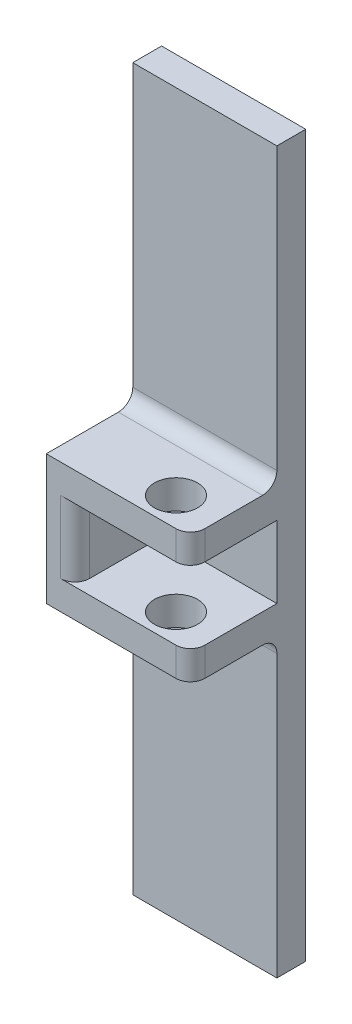
ISO-10303-21;
HEADER;
FILE_DESCRIPTION(('STEP AP214'),'2;1');
FILE_NAME('part.step','',(''),(''),'','','');
FILE_SCHEMA(('AUTOMOTIVE_DESIGN { 1 0 10303 214 1 1 1 1 }'));
ENDSEC;
DATA;
#1=APPLICATION_CONTEXT('core data for automotive mechanical design processes');
#2=APPLICATION_PROTOCOL_DEFINITION('international standard','automotive_design',2000,#1);
#3=PRODUCT_CONTEXT('',#1,'mechanical');
#4=PRODUCT('Part','Part','',(#3));
#5=PRODUCT_RELATED_PRODUCT_CATEGORY('part','',(#4));
#6=PRODUCT_DEFINITION_FORMATION('','',#4);
#7=PRODUCT_DEFINITION_CONTEXT('part definition',#1,'design');
#8=PRODUCT_DEFINITION('design','',#6,#7);
#9=PRODUCT_DEFINITION_SHAPE('','',#8);
#10=(LENGTH_UNIT() NAMED_UNIT(*) SI_UNIT(.MILLI.,.METRE.));
#11=(NAMED_UNIT(*) PLANE_ANGLE_UNIT() SI_UNIT($,.RADIAN.));
#12=(NAMED_UNIT(*) SI_UNIT($,.STERADIAN.) SOLID_ANGLE_UNIT());
#13=UNCERTAINTY_MEASURE_WITH_UNIT(LENGTH_MEASURE(1.E-05),#10,'distance_accuracy_value','');
#14=(GEOMETRIC_REPRESENTATION_CONTEXT(3) GLOBAL_UNCERTAINTY_ASSIGNED_CONTEXT((#13)) GLOBAL_UNIT_ASSIGNED_CONTEXT((#10,
#11,#12)) REPRESENTATION_CONTEXT('',''));
#15=CARTESIAN_POINT('',(0.,0.,0.));
#16=DIRECTION('',(0.,0.,1.));
#17=DIRECTION('',(1.,0.,0.));
#18=AXIS2_PLACEMENT_3D('',#15,#16,#17);
#19=CARTESIAN_POINT('',(0.,0.,3.));
#20=DIRECTION('',(0.,0.,-1.));
#21=DIRECTION('',(-1.,0.,0.));
#22=AXIS2_PLACEMENT_3D('',#19,#20,#21);
#23=PLANE('',#22);
#24=DIRECTION('',(0.,-1.,0.));
#25=VECTOR('',#24,1.);
#26=CARTESIAN_POINT('',(2.,27.5,3.));
#27=LINE('',#26,#25);
#28=CARTESIAN_POINT('',(2.,27.5,3.));
#29=VERTEX_POINT('',#28);
#30=CARTESIAN_POINT('',(2.,22.5,3.));
#31=VERTEX_POINT('',#30);
#32=EDGE_CURVE('E173',#29,#31,#27,.T.);
#33=ORIENTED_EDGE('',*,*,#32,.T.);
#34=DIRECTION('',(-1.,0.,0.));
#35=VECTOR('',#34,1.);
#36=CARTESIAN_POINT('',(0.,22.5,3.));
#37=LINE('',#36,#35);
#38=CARTESIAN_POINT('',(9.99999999999999,22.5,3.));
#39=VERTEX_POINT('',#38);
#40=EDGE_CURVE('E184',#39,#31,#37,.T.);
#41=ORIENTED_EDGE('',*,*,#40,.F.);
#42=DIRECTION('',(0.,1.,0.));
#43=VECTOR('',#42,1.);
#44=CARTESIAN_POINT('',(10.,0.,3.));
#45=LINE('',#44,#43);
#46=CARTESIAN_POINT('',(9.99999999999999,27.5,3.));
#47=VERTEX_POINT('',#46);
#48=EDGE_CURVE('E254',#39,#47,#45,.T.);
#49=ORIENTED_EDGE('',*,*,#48,.T.);
#50=DIRECTION('',(1.,0.,0.));
#51=VECTOR('',#50,1.);
#52=CARTESIAN_POINT('',(0.,27.5,3.));
#53=LINE('',#52,#51);
#54=EDGE_CURVE('E185',#29,#47,#53,.T.);
#55=ORIENTED_EDGE('',*,*,#54,.F.);
#56=EDGE_LOOP('',(#33,#41,#49,#55));
#57=FACE_BOUND('',#56,.T.);
#58=ADVANCED_FACE('F41',(#57),#23,.F.);
#59=CARTESIAN_POINT('',(0.,27.5,9.));
#60=DIRECTION('',(0.,1.,0.));
#61=DIRECTION('',(0.,0.,1.));
#62=AXIS2_PLACEMENT_3D('',#59,#60,#61);
#63=PLANE('',#62);
#64=CARTESIAN_POINT('',(6.99999999999999,27.5,7.));
#65=DIRECTION('',(0.,1.,0.));
#66=DIRECTION('',(0.,0.,1.));
#67=AXIS2_PLACEMENT_3D('',#64,#65,#66);
#68=CIRCLE('',#67,1.5);
#69=CARTESIAN_POINT('',(6.99999999999999,27.5,8.5));
#70=VERTEX_POINT('',#69);
#71=EDGE_CURVE('E194',#70,#70,#68,.T.);
#72=ORIENTED_EDGE('',*,*,#71,.T.);
#73=EDGE_LOOP('',(#72));
#74=FACE_BOUND('',#73,.T.);
#75=DIRECTION('',(1.,0.,0.));
#76=VECTOR('',#75,1.);
#77=CARTESIAN_POINT('',(0.,27.5,9.));
#78=LINE('',#77,#76);
#79=CARTESIAN_POINT('',(1.,27.5,9.));
#80=VERTEX_POINT('',#79);
#81=CARTESIAN_POINT('',(8.99999999999999,27.5,9.));
#82=VERTEX_POINT('',#81);
#83=EDGE_CURVE('E219',#80,#82,#78,.T.);
#84=ORIENTED_EDGE('',*,*,#83,.F.);
#85=CARTESIAN_POINT('',(1.,27.5,8.));
#86=DIRECTION('',(0.,1.,0.));
#87=DIRECTION('',(0.,0.,1.));
#88=AXIS2_PLACEMENT_3D('',#85,#86,#87);
#89=CIRCLE('',#88,1.);
#90=CARTESIAN_POINT('',(2.,27.5,8.));
#91=VERTEX_POINT('',#90);
#92=EDGE_CURVE('E50',#80,#91,#89,.T.);
#93=ORIENTED_EDGE('',*,*,#92,.T.);
#94=DIRECTION('',(0.,0.,-1.));
#95=VECTOR('',#94,1.);
#96=CARTESIAN_POINT('',(2.,27.5,3.));
#97=LINE('',#96,#95);
#98=EDGE_CURVE('E179',#91,#29,#97,.T.);
#99=ORIENTED_EDGE('',*,*,#98,.T.);
#100=ORIENTED_EDGE('',*,*,#54,.T.);
#101=DIRECTION('',(0.,0.,-1.));
#102=VECTOR('',#101,1.);
#103=CARTESIAN_POINT('',(9.99999999999999,27.5,9.));
#104=LINE('',#103,#102);
#105=CARTESIAN_POINT('',(9.99999999999999,27.5,8.));
#106=VERTEX_POINT('',#105);
#107=EDGE_CURVE('E235',#106,#47,#104,.T.);
#108=ORIENTED_EDGE('',*,*,#107,.F.);
#109=CARTESIAN_POINT('',(8.99999999999999,27.5,8.));
#110=DIRECTION('',(0.,1.,0.));
#111=DIRECTION('',(0.,0.,1.));
#112=AXIS2_PLACEMENT_3D('',#109,#110,#111);
#113=CIRCLE('',#112,1.);
#114=EDGE_CURVE('E330',#106,#82,#113,.F.);
#115=ORIENTED_EDGE('',*,*,#114,.T.);
#116=EDGE_LOOP('',(#84,#93,#99,#100,#108,#115));
#117=FACE_BOUND('',#116,.T.);
#118=ADVANCED_FACE('F393',(#74,#117),#63,.F.);
#119=CARTESIAN_POINT('',(0.,22.5,9.));
#120=DIRECTION('',(0.,-1.,0.));
#121=DIRECTION('',(0.,0.,-1.));
#122=AXIS2_PLACEMENT_3D('',#119,#120,#121);
#123=PLANE('',#122);
#124=CARTESIAN_POINT('',(6.99999999999999,22.5,7.));
#125=DIRECTION('',(0.,-1.,0.));
#126=DIRECTION('',(0.,0.,-1.));
#127=AXIS2_PLACEMENT_3D('',#124,#125,#126);
#128=CIRCLE('',#127,1.5);
#129=CARTESIAN_POINT('',(6.99999999999999,22.5,5.5));
#130=VERTEX_POINT('',#129);
#131=EDGE_CURVE('E313',#130,#130,#128,.T.);
#132=ORIENTED_EDGE('',*,*,#131,.T.);
#133=EDGE_LOOP('',(#132));
#134=FACE_BOUND('',#133,.T.);
#135=DIRECTION('',(0.,0.,1.));
#136=VECTOR('',#135,1.);
#137=CARTESIAN_POINT('',(2.,22.5,3.));
#138=LINE('',#137,#136);
#139=CARTESIAN_POINT('',(2.,22.5,8.));
#140=VERTEX_POINT('',#139);
#141=EDGE_CURVE('E170',#31,#140,#138,.T.);
#142=ORIENTED_EDGE('',*,*,#141,.T.);
#143=CARTESIAN_POINT('',(1.,22.5,8.));
#144=DIRECTION('',(0.,-1.,0.));
#145=DIRECTION('',(0.,0.,-1.));
#146=AXIS2_PLACEMENT_3D('',#143,#144,#145);
#147=CIRCLE('',#146,1.);
#148=CARTESIAN_POINT('',(1.,22.5,9.));
#149=VERTEX_POINT('',#148);
#150=EDGE_CURVE('E11',#140,#149,#147,.T.);
#151=ORIENTED_EDGE('',*,*,#150,.T.);
#152=DIRECTION('',(-1.,0.,0.));
#153=VECTOR('',#152,1.);
#154=CARTESIAN_POINT('',(0.,22.5,9.));
#155=LINE('',#154,#153);
#156=CARTESIAN_POINT('',(8.99999999999999,22.5,9.));
#157=VERTEX_POINT('',#156);
#158=EDGE_CURVE('E199',#157,#149,#155,.T.);
#159=ORIENTED_EDGE('',*,*,#158,.F.);
#160=CARTESIAN_POINT('',(8.99999999999999,22.5,8.));
#161=DIRECTION('',(0.,-1.,0.));
#162=DIRECTION('',(0.,0.,-1.));
#163=AXIS2_PLACEMENT_3D('',#160,#161,#162);
#164=CIRCLE('',#163,1.);
#165=CARTESIAN_POINT('',(9.99999999999999,22.5,8.));
#166=VERTEX_POINT('',#165);
#167=EDGE_CURVE('E338',#157,#166,#164,.F.);
#168=ORIENTED_EDGE('',*,*,#167,.T.);
#169=DIRECTION('',(0.,0.,-1.));
#170=VECTOR('',#169,1.);
#171=CARTESIAN_POINT('',(9.99999999999999,22.5,9.));
#172=LINE('',#171,#170);
#173=EDGE_CURVE('E190',#166,#39,#172,.T.);
#174=ORIENTED_EDGE('',*,*,#173,.T.);
#175=ORIENTED_EDGE('',*,*,#40,.T.);
#176=EDGE_LOOP('',(#142,#151,#159,#168,#174,#175));
#177=FACE_BOUND('',#176,.T.);
#178=ADVANCED_FACE('F188',(#134,#177),#123,.F.);
#179=CARTESIAN_POINT('',(10.,0.,3.));
#180=VERTEX_POINT('',#179);
#181=CARTESIAN_POINT('',(9.99999999999999,19.5,3.));
#182=VERTEX_POINT('',#181);
#183=EDGE_CURVE('E249',#180,#182,#45,.T.);
#184=ORIENTED_EDGE('',*,*,#183,.T.);
#185=DIRECTION('',(1.,0.,0.));
#186=VECTOR('',#185,1.);
#187=CARTESIAN_POINT('',(0.,19.5,3.));
#188=LINE('',#187,#186);
#189=CARTESIAN_POINT('',(0.,19.5,3.));
#190=VERTEX_POINT('',#189);
#191=EDGE_CURVE('E355',#182,#190,#188,.F.);
#192=ORIENTED_EDGE('',*,*,#191,.T.);
#193=DIRECTION('',(0.,-1.,0.));
#194=VECTOR('',#193,1.);
#195=CARTESIAN_POINT('',(0.,0.,3.));
#196=LINE('',#195,#194);
#197=CARTESIAN_POINT('',(0.,0.,3.));
#198=VERTEX_POINT('',#197);
#199=EDGE_CURVE('E245',#190,#198,#196,.T.);
#200=ORIENTED_EDGE('',*,*,#199,.T.);
#201=DIRECTION('',(1.,0.,0.));
#202=VECTOR('',#201,1.);
#203=CARTESIAN_POINT('',(0.,0.,3.));
#204=LINE('',#203,#202);
#205=EDGE_CURVE('E244',#198,#180,#204,.T.);
#206=ORIENTED_EDGE('',*,*,#205,.T.);
#207=EDGE_LOOP('',(#184,#192,#200,#206));
#208=FACE_BOUND('',#207,.T.);
#209=ADVANCED_FACE('F395',(#208),#23,.F.);
#210=CARTESIAN_POINT('',(0.,50.,3.));
#211=VERTEX_POINT('',#210);
#212=CARTESIAN_POINT('',(0.,30.5,3.));
#213=VERTEX_POINT('',#212);
#214=EDGE_CURVE('E240',#211,#213,#196,.T.);
#215=ORIENTED_EDGE('',*,*,#214,.T.);
#216=DIRECTION('',(-1.,0.,0.));
#217=VECTOR('',#216,1.);
#218=CARTESIAN_POINT('',(9.99999999999999,30.5,3.));
#219=LINE('',#218,#217);
#220=CARTESIAN_POINT('',(9.99999999999999,30.5,3.));
#221=VERTEX_POINT('',#220);
#222=EDGE_CURVE('E348',#213,#221,#219,.F.);
#223=ORIENTED_EDGE('',*,*,#222,.T.);
#224=CARTESIAN_POINT('',(9.99999999999999,50.,3.));
#225=VERTEX_POINT('',#224);
#226=EDGE_CURVE('E248',#221,#225,#45,.T.);
#227=ORIENTED_EDGE('',*,*,#226,.T.);
#228=DIRECTION('',(-1.,0.,0.));
#229=VECTOR('',#228,1.);
#230=CARTESIAN_POINT('',(0.,50.,3.));
#231=LINE('',#230,#229);
#232=EDGE_CURVE('E253',#225,#211,#231,.T.);
#233=ORIENTED_EDGE('',*,*,#232,.T.);
#234=EDGE_LOOP('',(#215,#223,#227,#233));
#235=FACE_BOUND('',#234,.T.);
#236=ADVANCED_FACE('F396',(#235),#23,.F.);
#237=CARTESIAN_POINT('',(0.,0.,3.));
#238=DIRECTION('',(1.,0.,0.));
#239=DIRECTION('',(0.,0.,-1.));
#240=AXIS2_PLACEMENT_3D('',#237,#238,#239);
#241=PLANE('',#240);
#242=DIRECTION('',(0.,0.,-1.));
#243=VECTOR('',#242,1.);
#244=CARTESIAN_POINT('',(0.,50.,3.));
#245=LINE('',#244,#243);
#246=CARTESIAN_POINT('',(0.,50.,1.));
#247=VERTEX_POINT('',#246);
#248=EDGE_CURVE('E257',#211,#247,#245,.T.);
#249=ORIENTED_EDGE('',*,*,#248,.T.);
#250=DIRECTION('',(0.,-1.,0.));
#251=VECTOR('',#250,1.);
#252=CARTESIAN_POINT('',(0.,0.,1.));
#253=LINE('',#252,#251);
#254=CARTESIAN_POINT('',(0.,0.,1.));
#255=VERTEX_POINT('',#254);
#256=EDGE_CURVE('E296',#247,#255,#253,.T.);
#257=ORIENTED_EDGE('',*,*,#256,.T.);
#258=DIRECTION('',(0.,0.,-1.));
#259=VECTOR('',#258,1.);
#260=CARTESIAN_POINT('',(0.,0.,3.));
#261=LINE('',#260,#259);
#262=EDGE_CURVE('E269',#198,#255,#261,.T.);
#263=ORIENTED_EDGE('',*,*,#262,.F.);
#264=ORIENTED_EDGE('',*,*,#199,.F.);
#265=CARTESIAN_POINT('',(0.,19.5,4.));
#266=DIRECTION('',(1.,0.,0.));
#267=DIRECTION('',(0.,0.,-1.));
#268=AXIS2_PLACEMENT_3D('',#265,#266,#267);
#269=CIRCLE('',#268,1.);
#270=CARTESIAN_POINT('',(0.,20.5,4.));
#271=VERTEX_POINT('',#270);
#272=EDGE_CURVE('E367',#190,#271,#269,.T.);
#273=ORIENTED_EDGE('',*,*,#272,.T.);
#274=DIRECTION('',(0.,0.,-1.));
#275=VECTOR('',#274,1.);
#276=CARTESIAN_POINT('',(0.,20.5,9.));
#277=LINE('',#276,#275);
#278=CARTESIAN_POINT('',(0.,20.5,9.));
#279=VERTEX_POINT('',#278);
#280=EDGE_CURVE('E206',#279,#271,#277,.T.);
#281=ORIENTED_EDGE('',*,*,#280,.F.);
#282=DIRECTION('',(0.,-1.,0.));
#283=VECTOR('',#282,1.);
#284=CARTESIAN_POINT('',(0.,29.5,9.));
#285=LINE('',#284,#283);
#286=CARTESIAN_POINT('',(0.,29.5,9.));
#287=VERTEX_POINT('',#286);
#288=EDGE_CURVE('E216',#287,#279,#285,.T.);
#289=ORIENTED_EDGE('',*,*,#288,.F.);
#290=DIRECTION('',(0.,0.,-1.));
#291=VECTOR('',#290,1.);
#292=CARTESIAN_POINT('',(0.,29.5,9.));
#293=LINE('',#292,#291);
#294=CARTESIAN_POINT('',(0.,29.5,4.));
#295=VERTEX_POINT('',#294);
#296=EDGE_CURVE('E225',#287,#295,#293,.T.);
#297=ORIENTED_EDGE('',*,*,#296,.T.);
#298=CARTESIAN_POINT('',(0.,30.5,4.));
#299=DIRECTION('',(1.,0.,0.));
#300=DIRECTION('',(0.,0.,-1.));
#301=AXIS2_PLACEMENT_3D('',#298,#299,#300);
#302=CIRCLE('',#301,1.);
#303=EDGE_CURVE('E358',#295,#213,#302,.T.);
#304=ORIENTED_EDGE('',*,*,#303,.T.);
#305=ORIENTED_EDGE('',*,*,#214,.F.);
#306=EDGE_LOOP('',(#249,#257,#263,#264,#273,#281,#289,#297,#304,#305));
#307=FACE_BOUND('',#306,.T.);
#308=ADVANCED_FACE('F406',(#307),#241,.F.);
#309=CARTESIAN_POINT('',(0.,0.,3.));
#310=DIRECTION('',(0.,1.,0.));
#311=DIRECTION('',(0.,0.,1.));
#312=AXIS2_PLACEMENT_3D('',#309,#310,#311);
#313=PLANE('',#312);
#314=ORIENTED_EDGE('',*,*,#262,.T.);
#315=DIRECTION('',(1.,0.,0.));
#316=VECTOR('',#315,1.);
#317=CARTESIAN_POINT('',(10.,0.,1.));
#318=LINE('',#317,#316);
#319=CARTESIAN_POINT('',(10.,0.,1.));
#320=VERTEX_POINT('',#319);
#321=EDGE_CURVE('E273',#255,#320,#318,.T.);
#322=ORIENTED_EDGE('',*,*,#321,.T.);
#323=DIRECTION('',(0.,0.,-1.));
#324=VECTOR('',#323,1.);
#325=CARTESIAN_POINT('',(10.,0.,3.));
#326=LINE('',#325,#324);
#327=EDGE_CURVE('E265',#180,#320,#326,.T.);
#328=ORIENTED_EDGE('',*,*,#327,.F.);
#329=ORIENTED_EDGE('',*,*,#205,.F.);
#330=EDGE_LOOP('',(#314,#322,#328,#329));
#331=FACE_BOUND('',#330,.T.);
#332=ADVANCED_FACE('F411',(#331),#313,.F.);
#333=CARTESIAN_POINT('',(10.,0.,3.));
#334=DIRECTION('',(-1.,0.,0.));
#335=DIRECTION('',(0.,-1.,0.));
#336=AXIS2_PLACEMENT_3D('',#333,#334,#335);
#337=PLANE('',#336);
#338=DIRECTION('',(0.,0.,-1.));
#339=VECTOR('',#338,1.);
#340=CARTESIAN_POINT('',(9.99999999999999,29.5,9.));
#341=LINE('',#340,#339);
#342=CARTESIAN_POINT('',(9.99999999999999,29.5,8.));
#343=VERTEX_POINT('',#342);
#344=CARTESIAN_POINT('',(9.99999999999999,29.5,4.));
#345=VERTEX_POINT('',#344);
#346=EDGE_CURVE('E231',#343,#345,#341,.T.);
#347=ORIENTED_EDGE('',*,*,#346,.F.);
#348=DIRECTION('',(0.,1.,0.));
#349=VECTOR('',#348,1.);
#350=CARTESIAN_POINT('',(9.99999999999999,27.5,8.));
#351=LINE('',#350,#349);
#352=EDGE_CURVE('E327',#343,#106,#351,.F.);
#353=ORIENTED_EDGE('',*,*,#352,.T.);
#354=ORIENTED_EDGE('',*,*,#107,.T.);
#355=ORIENTED_EDGE('',*,*,#48,.F.);
#356=ORIENTED_EDGE('',*,*,#173,.F.);
#357=DIRECTION('',(0.,1.,0.));
#358=VECTOR('',#357,1.);
#359=CARTESIAN_POINT('',(9.99999999999999,20.5,8.));
#360=LINE('',#359,#358);
#361=CARTESIAN_POINT('',(9.99999999999999,20.5,8.));
#362=VERTEX_POINT('',#361);
#363=EDGE_CURVE('E324',#166,#362,#360,.F.);
#364=ORIENTED_EDGE('',*,*,#363,.T.);
#365=DIRECTION('',(0.,0.,-1.));
#366=VECTOR('',#365,1.);
#367=CARTESIAN_POINT('',(9.99999999999999,20.5,9.));
#368=LINE('',#367,#366);
#369=CARTESIAN_POINT('',(9.99999999999999,20.5,4.));
#370=VERTEX_POINT('',#369);
#371=EDGE_CURVE('E212',#362,#370,#368,.T.);
#372=ORIENTED_EDGE('',*,*,#371,.T.);
#373=CARTESIAN_POINT('',(9.99999999999999,19.5,4.));
#374=DIRECTION('',(-1.,0.,0.));
#375=DIRECTION('',(0.,-1.,0.));
#376=AXIS2_PLACEMENT_3D('',#373,#374,#375);
#377=CIRCLE('',#376,1.);
#378=EDGE_CURVE('E364',#370,#182,#377,.T.);
#379=ORIENTED_EDGE('',*,*,#378,.T.);
#380=ORIENTED_EDGE('',*,*,#183,.F.);
#381=ORIENTED_EDGE('',*,*,#327,.T.);
#382=DIRECTION('',(0.,1.,0.));
#383=VECTOR('',#382,1.);
#384=CARTESIAN_POINT('',(9.99999999999999,50.,1.));
#385=LINE('',#384,#383);
#386=CARTESIAN_POINT('',(9.99999999999999,50.,1.));
#387=VERTEX_POINT('',#386);
#388=EDGE_CURVE('E290',#320,#387,#385,.T.);
#389=ORIENTED_EDGE('',*,*,#388,.T.);
#390=DIRECTION('',(0.,0.,-1.));
#391=VECTOR('',#390,1.);
#392=CARTESIAN_POINT('',(9.99999999999999,50.,3.));
#393=LINE('',#392,#391);
#394=EDGE_CURVE('E261',#225,#387,#393,.T.);
#395=ORIENTED_EDGE('',*,*,#394,.F.);
#396=ORIENTED_EDGE('',*,*,#226,.F.);
#397=CARTESIAN_POINT('',(9.99999999999999,30.5,4.));
#398=DIRECTION('',(-1.,0.,0.));
#399=DIRECTION('',(0.,-1.,0.));
#400=AXIS2_PLACEMENT_3D('',#397,#398,#399);
#401=CIRCLE('',#400,1.);
#402=EDGE_CURVE('E361',#221,#345,#401,.T.);
#403=ORIENTED_EDGE('',*,*,#402,.T.);
#404=EDGE_LOOP('',(#347,#353,#354,#355,#356,#364,#372,#379,#380,#381,#389,#395,#396,#403));
#405=FACE_BOUND('',#404,.T.);
#406=ADVANCED_FACE('F425',(#405),#337,.F.);
#407=CARTESIAN_POINT('',(0.,50.,3.));
#408=DIRECTION('',(0.,-1.,0.));
#409=DIRECTION('',(0.,0.,-1.));
#410=AXIS2_PLACEMENT_3D('',#407,#408,#409);
#411=PLANE('',#410);
#412=ORIENTED_EDGE('',*,*,#394,.T.);
#413=DIRECTION('',(-1.,0.,0.));
#414=VECTOR('',#413,1.);
#415=CARTESIAN_POINT('',(0.,50.,1.));
#416=LINE('',#415,#414);
#417=EDGE_CURVE('E293',#387,#247,#416,.T.);
#418=ORIENTED_EDGE('',*,*,#417,.T.);
#419=ORIENTED_EDGE('',*,*,#248,.F.);
#420=ORIENTED_EDGE('',*,*,#232,.F.);
#421=EDGE_LOOP('',(#412,#418,#419,#420));
#422=FACE_BOUND('',#421,.T.);
#423=ADVANCED_FACE('F463',(#422),#411,.F.);
#424=CARTESIAN_POINT('',(0.,0.,0.));
#425=DIRECTION('',(0.,0.,-1.));
#426=DIRECTION('',(-1.,0.,0.));
#427=AXIS2_PLACEMENT_3D('',#424,#425,#426);
#428=PLANE('',#427);
#429=DIRECTION('',(0.,-1.,0.));
#430=VECTOR('',#429,1.);
#431=CARTESIAN_POINT('',(8.99999999999999,0.,0.));
#432=LINE('',#431,#430);
#433=CARTESIAN_POINT('',(8.99999999999998,49.,0.));
#434=VERTEX_POINT('',#433);
#435=CARTESIAN_POINT('',(8.99999999999999,1.00000000000001,0.));
#436=VERTEX_POINT('',#435);
#437=EDGE_CURVE('E283',#434,#436,#432,.T.);
#438=ORIENTED_EDGE('',*,*,#437,.T.);
#439=DIRECTION('',(-1.,0.,0.));
#440=VECTOR('',#439,1.);
#441=CARTESIAN_POINT('',(0.,1.00000000000001,0.));
#442=LINE('',#441,#440);
#443=CARTESIAN_POINT('',(1.00000000000001,1.00000000000001,0.));
#444=VERTEX_POINT('',#443);
#445=EDGE_CURVE('E286',#436,#444,#442,.T.);
#446=ORIENTED_EDGE('',*,*,#445,.T.);
#447=DIRECTION('',(0.,1.,0.));
#448=VECTOR('',#447,1.);
#449=CARTESIAN_POINT('',(1.00000000000001,50.,0.));
#450=LINE('',#449,#448);
#451=CARTESIAN_POINT('',(1.00000000000001,49.,0.));
#452=VERTEX_POINT('',#451);
#453=EDGE_CURVE('E277',#444,#452,#450,.T.);
#454=ORIENTED_EDGE('',*,*,#453,.T.);
#455=DIRECTION('',(1.,0.,0.));
#456=VECTOR('',#455,1.);
#457=CARTESIAN_POINT('',(9.99999999999999,49.,0.));
#458=LINE('',#457,#456);
#459=EDGE_CURVE('E280',#452,#434,#458,.T.);
#460=ORIENTED_EDGE('',*,*,#459,.T.);
#461=EDGE_LOOP('',(#438,#446,#454,#460));
#462=FACE_BOUND('',#461,.T.);
#463=ADVANCED_FACE('F474',(#462),#428,.T.);
#464=CARTESIAN_POINT('',(0.,50.,1.));
#465=DIRECTION('',(0.,0.707106781186545,-0.70710678118655));
#466=DIRECTION('',(1.,0.,0.));
#467=AXIS2_PLACEMENT_3D('',#464,#465,#466);
#468=PLANE('',#467);
#469=DIRECTION('',(-0.577350269189627,-0.577350269189627,-0.577350269189623));
#470=VECTOR('',#469,1.);
#471=CARTESIAN_POINT('',(6.66666666666665,46.6666666666667,-2.33333333333332));
#472=LINE('',#471,#470);
#473=EDGE_CURVE('E305',#434,#387,#472,.F.);
#474=ORIENTED_EDGE('',*,*,#473,.F.);
#475=ORIENTED_EDGE('',*,*,#459,.F.);
#476=DIRECTION('',(0.577350269189627,-0.577350269189627,-0.577350269189623));
#477=VECTOR('',#476,1.);
#478=CARTESIAN_POINT('',(16.6666666666667,33.3333333333333,-15.6666666666666));
#479=LINE('',#478,#477);
#480=EDGE_CURVE('E309',#247,#452,#479,.T.);
#481=ORIENTED_EDGE('',*,*,#480,.F.);
#482=ORIENTED_EDGE('',*,*,#417,.F.);
#483=EDGE_LOOP('',(#474,#475,#481,#482));
#484=FACE_BOUND('',#483,.T.);
#485=ADVANCED_FACE('F467',(#484),#468,.T.);
#486=CARTESIAN_POINT('',(0.,0.,1.));
#487=DIRECTION('',(-0.707106781186545,0.,-0.70710678118655));
#488=DIRECTION('',(0.,1.,0.));
#489=AXIS2_PLACEMENT_3D('',#486,#487,#488);
#490=PLANE('',#489);
#491=ORIENTED_EDGE('',*,*,#480,.T.);
#492=ORIENTED_EDGE('',*,*,#453,.F.);
#493=DIRECTION('',(-0.577350269189627,-0.577350269189627,0.577350269189623));
#494=VECTOR('',#493,1.);
#495=CARTESIAN_POINT('',(0.,0.,1.));
#496=LINE('',#495,#494);
#497=EDGE_CURVE('E302',#255,#444,#496,.F.);
#498=ORIENTED_EDGE('',*,*,#497,.F.);
#499=ORIENTED_EDGE('',*,*,#256,.F.);
#500=EDGE_LOOP('',(#491,#492,#498,#499));
#501=FACE_BOUND('',#500,.T.);
#502=ADVANCED_FACE('F480',(#501),#490,.T.);
#503=CARTESIAN_POINT('',(10.,0.,1.));
#504=DIRECTION('',(0.707106781186545,0.,-0.70710678118655));
#505=DIRECTION('',(0.,-1.,0.));
#506=AXIS2_PLACEMENT_3D('',#503,#504,#505);
#507=PLANE('',#506);
#508=ORIENTED_EDGE('',*,*,#473,.T.);
#509=ORIENTED_EDGE('',*,*,#388,.F.);
#510=DIRECTION('',(-0.577350269189627,0.577350269189627,-0.577350269189623));
#511=VECTOR('',#510,1.);
#512=CARTESIAN_POINT('',(10.,0.,1.));
#513=LINE('',#512,#511);
#514=EDGE_CURVE('E239',#436,#320,#513,.F.);
#515=ORIENTED_EDGE('',*,*,#514,.F.);
#516=ORIENTED_EDGE('',*,*,#437,.F.);
#517=EDGE_LOOP('',(#508,#509,#515,#516));
#518=FACE_BOUND('',#517,.T.);
#519=ADVANCED_FACE('F471',(#518),#507,.T.);
#520=CARTESIAN_POINT('',(0.,0.,1.));
#521=DIRECTION('',(0.,-0.707106781186545,-0.70710678118655));
#522=DIRECTION('',(-1.,0.,0.));
#523=AXIS2_PLACEMENT_3D('',#520,#521,#522);
#524=PLANE('',#523);
#525=ORIENTED_EDGE('',*,*,#497,.T.);
#526=ORIENTED_EDGE('',*,*,#445,.F.);
#527=ORIENTED_EDGE('',*,*,#514,.T.);
#528=ORIENTED_EDGE('',*,*,#321,.F.);
#529=EDGE_LOOP('',(#525,#526,#527,#528));
#530=FACE_BOUND('',#529,.T.);
#531=ADVANCED_FACE('F476',(#530),#524,.T.);
#532=CARTESIAN_POINT('',(0.,29.5,9.));
#533=DIRECTION('',(0.,-1.,0.));
#534=DIRECTION('',(0.,0.,-1.));
#535=AXIS2_PLACEMENT_3D('',#532,#533,#534);
#536=PLANE('',#535);
#537=CARTESIAN_POINT('',(6.99999999999999,29.5,7.));
#538=DIRECTION('',(0.,-1.,0.));
#539=DIRECTION('',(0.,0.,-1.));
#540=AXIS2_PLACEMENT_3D('',#537,#538,#539);
#541=CIRCLE('',#540,1.5);
#542=CARTESIAN_POINT('',(6.99999999999999,29.5,5.5));
#543=VERTEX_POINT('',#542);
#544=EDGE_CURVE('E202',#543,#543,#541,.T.);
#545=ORIENTED_EDGE('',*,*,#544,.T.);
#546=EDGE_LOOP('',(#545));
#547=FACE_BOUND('',#546,.T.);
#548=ORIENTED_EDGE('',*,*,#346,.T.);
#549=DIRECTION('',(-1.,0.,0.));
#550=VECTOR('',#549,1.);
#551=CARTESIAN_POINT('',(0.,29.5,4.));
#552=LINE('',#551,#550);
#553=EDGE_CURVE('E344',#345,#295,#552,.T.);
#554=ORIENTED_EDGE('',*,*,#553,.T.);
#555=ORIENTED_EDGE('',*,*,#296,.F.);
#556=DIRECTION('',(-1.,0.,0.));
#557=VECTOR('',#556,1.);
#558=CARTESIAN_POINT('',(0.,29.5,9.));
#559=LINE('',#558,#557);
#560=CARTESIAN_POINT('',(8.99999999999999,29.5,9.));
#561=VERTEX_POINT('',#560);
#562=EDGE_CURVE('E222',#561,#287,#559,.T.);
#563=ORIENTED_EDGE('',*,*,#562,.F.);
#564=CARTESIAN_POINT('',(8.99999999999999,29.5,8.));
#565=DIRECTION('',(0.,-1.,0.));
#566=DIRECTION('',(0.,0.,-1.));
#567=AXIS2_PLACEMENT_3D('',#564,#565,#566);
#568=CIRCLE('',#567,1.);
#569=EDGE_CURVE('E321',#561,#343,#568,.F.);
#570=ORIENTED_EDGE('',*,*,#569,.T.);
#571=EDGE_LOOP('',(#548,#554,#555,#563,#570));
#572=FACE_BOUND('',#571,.T.);
#573=ADVANCED_FACE('F429',(#547,#572),#536,.F.);
#574=CARTESIAN_POINT('',(0.,0.,9.));
#575=DIRECTION('',(0.,0.,1.));
#576=DIRECTION('',(1.,0.,0.));
#577=AXIS2_PLACEMENT_3D('',#574,#575,#576);
#578=PLANE('',#577);
#579=DIRECTION('',(0.,1.,0.));
#580=VECTOR('',#579,1.);
#581=CARTESIAN_POINT('',(1.,27.5,9.));
#582=LINE('',#581,#580);
#583=EDGE_CURVE('E370',#149,#80,#582,.T.);
#584=ORIENTED_EDGE('',*,*,#583,.T.);
#585=ORIENTED_EDGE('',*,*,#83,.T.);
#586=DIRECTION('',(0.,1.,0.));
#587=VECTOR('',#586,1.);
#588=CARTESIAN_POINT('',(8.99999999999999,29.5,9.));
#589=LINE('',#588,#587);
#590=EDGE_CURVE('E299',#82,#561,#589,.T.);
#591=ORIENTED_EDGE('',*,*,#590,.T.);
#592=ORIENTED_EDGE('',*,*,#562,.T.);
#593=ORIENTED_EDGE('',*,*,#288,.T.);
#594=DIRECTION('',(1.,0.,0.));
#595=VECTOR('',#594,1.);
#596=CARTESIAN_POINT('',(0.,20.5,9.));
#597=LINE('',#596,#595);
#598=CARTESIAN_POINT('',(8.99999999999999,20.5,9.));
#599=VERTEX_POINT('',#598);
#600=EDGE_CURVE('E193',#279,#599,#597,.T.);
#601=ORIENTED_EDGE('',*,*,#600,.T.);
#602=DIRECTION('',(0.,1.,0.));
#603=VECTOR('',#602,1.);
#604=CARTESIAN_POINT('',(8.99999999999999,22.5,9.));
#605=LINE('',#604,#603);
#606=EDGE_CURVE('E334',#599,#157,#605,.T.);
#607=ORIENTED_EDGE('',*,*,#606,.T.);
#608=ORIENTED_EDGE('',*,*,#158,.T.);
#609=EDGE_LOOP('',(#584,#585,#591,#592,#593,#601,#607,#608));
#610=FACE_BOUND('',#609,.T.);
#611=ADVANCED_FACE('F382',(#610),#578,.T.);
#612=CARTESIAN_POINT('',(0.,20.5,9.));
#613=DIRECTION('',(0.,1.,0.));
#614=DIRECTION('',(0.,0.,1.));
#615=AXIS2_PLACEMENT_3D('',#612,#613,#614);
#616=PLANE('',#615);
#617=CARTESIAN_POINT('',(6.99999999999999,20.5,7.));
#618=DIRECTION('',(0.,-1.,0.));
#619=DIRECTION('',(0.,0.,-1.));
#620=AXIS2_PLACEMENT_3D('',#617,#618,#619);
#621=CIRCLE('',#620,1.5);
#622=CARTESIAN_POINT('',(6.99999999999999,20.5,5.5));
#623=VERTEX_POINT('',#622);
#624=EDGE_CURVE('E317',#623,#623,#621,.T.);
#625=ORIENTED_EDGE('',*,*,#624,.F.);
#626=EDGE_LOOP('',(#625));
#627=FACE_BOUND('',#626,.T.);
#628=ORIENTED_EDGE('',*,*,#280,.T.);
#629=DIRECTION('',(1.,0.,0.));
#630=VECTOR('',#629,1.);
#631=CARTESIAN_POINT('',(9.99999999999999,20.5,4.));
#632=LINE('',#631,#630);
#633=EDGE_CURVE('E351',#271,#370,#632,.T.);
#634=ORIENTED_EDGE('',*,*,#633,.T.);
#635=ORIENTED_EDGE('',*,*,#371,.F.);
#636=CARTESIAN_POINT('',(8.99999999999999,20.5,8.));
#637=DIRECTION('',(0.,1.,0.));
#638=DIRECTION('',(0.,0.,1.));
#639=AXIS2_PLACEMENT_3D('',#636,#637,#638);
#640=CIRCLE('',#639,1.);
#641=EDGE_CURVE('E341',#362,#599,#640,.F.);
#642=ORIENTED_EDGE('',*,*,#641,.T.);
#643=ORIENTED_EDGE('',*,*,#600,.F.);
#644=EDGE_LOOP('',(#628,#634,#635,#642,#643));
#645=FACE_BOUND('',#644,.T.);
#646=ADVANCED_FACE('F444',(#627,#645),#616,.F.);
#647=CARTESIAN_POINT('',(6.99999999999999,30.5,7.));
#648=DIRECTION('',(0.,-1.,0.));
#649=DIRECTION('',(0.,0.,-1.));
#650=AXIS2_PLACEMENT_3D('',#647,#648,#649);
#651=CYLINDRICAL_SURFACE('',#650,1.5);
#652=ORIENTED_EDGE('',*,*,#624,.T.);
#653=EDGE_LOOP('',(#652));
#654=FACE_BOUND('',#653,.T.);
#655=ORIENTED_EDGE('',*,*,#131,.F.);
#656=EDGE_LOOP('',(#655));
#657=FACE_BOUND('',#656,.T.);
#658=ADVANCED_FACE('F574',(#654,#657),#651,.F.);
#659=ORIENTED_EDGE('',*,*,#544,.F.);
#660=EDGE_LOOP('',(#659));
#661=FACE_BOUND('',#660,.T.);
#662=ORIENTED_EDGE('',*,*,#71,.F.);
#663=EDGE_LOOP('',(#662));
#664=FACE_BOUND('',#663,.T.);
#665=ADVANCED_FACE('F500',(#661,#664),#651,.F.);
#666=CARTESIAN_POINT('',(9.,0.,8.));
#667=DIRECTION('',(0.,-1.,0.));
#668=DIRECTION('',(1.,0.,0.));
#669=AXIS2_PLACEMENT_3D('',#666,#667,#668);
#670=CYLINDRICAL_SURFACE('',#669,1.);
#671=ORIENTED_EDGE('',*,*,#114,.F.);
#672=ORIENTED_EDGE('',*,*,#352,.F.);
#673=ORIENTED_EDGE('',*,*,#569,.F.);
#674=ORIENTED_EDGE('',*,*,#590,.F.);
#675=EDGE_LOOP('',(#671,#672,#673,#674));
#676=FACE_BOUND('',#675,.T.);
#677=ADVANCED_FACE('F435',(#676),#670,.T.);
#678=CARTESIAN_POINT('',(9.,0.,8.));
#679=DIRECTION('',(0.,-1.,0.));
#680=DIRECTION('',(1.,0.,0.));
#681=AXIS2_PLACEMENT_3D('',#678,#679,#680);
#682=CYLINDRICAL_SURFACE('',#681,1.);
#683=ORIENTED_EDGE('',*,*,#641,.F.);
#684=ORIENTED_EDGE('',*,*,#363,.F.);
#685=ORIENTED_EDGE('',*,*,#167,.F.);
#686=ORIENTED_EDGE('',*,*,#606,.F.);
#687=EDGE_LOOP('',(#683,#684,#685,#686));
#688=FACE_BOUND('',#687,.T.);
#689=ADVANCED_FACE('F441',(#688),#682,.T.);
#690=CARTESIAN_POINT('',(0.,30.5,4.));
#691=DIRECTION('',(1.,0.,0.));
#692=DIRECTION('',(0.,0.,-1.));
#693=AXIS2_PLACEMENT_3D('',#690,#691,#692);
#694=CYLINDRICAL_SURFACE('',#693,1.);
#695=ORIENTED_EDGE('',*,*,#402,.F.);
#696=ORIENTED_EDGE('',*,*,#222,.F.);
#697=ORIENTED_EDGE('',*,*,#303,.F.);
#698=ORIENTED_EDGE('',*,*,#553,.F.);
#699=EDGE_LOOP('',(#695,#696,#697,#698));
#700=FACE_BOUND('',#699,.T.);
#701=ADVANCED_FACE('F421',(#700),#694,.F.);
#702=CARTESIAN_POINT('',(0.,19.5,4.));
#703=DIRECTION('',(-1.,0.,0.));
#704=DIRECTION('',(0.,0.,1.));
#705=AXIS2_PLACEMENT_3D('',#702,#703,#704);
#706=CYLINDRICAL_SURFACE('',#705,1.);
#707=ORIENTED_EDGE('',*,*,#272,.F.);
#708=ORIENTED_EDGE('',*,*,#191,.F.);
#709=ORIENTED_EDGE('',*,*,#378,.F.);
#710=ORIENTED_EDGE('',*,*,#633,.F.);
#711=EDGE_LOOP('',(#707,#708,#709,#710));
#712=FACE_BOUND('',#711,.T.);
#713=ADVANCED_FACE('F390',(#712),#706,.F.);
#714=CARTESIAN_POINT('',(2.,0.,0.));
#715=DIRECTION('',(-1.,0.,0.));
#716=DIRECTION('',(0.,0.,1.));
#717=AXIS2_PLACEMENT_3D('',#714,#715,#716);
#718=PLANE('',#717);
#719=ORIENTED_EDGE('',*,*,#98,.F.);
#720=DIRECTION('',(0.,1.,0.));
#721=VECTOR('',#720,1.);
#722=CARTESIAN_POINT('',(2.,22.5,8.));
#723=LINE('',#722,#721);
#724=EDGE_CURVE('E57',#91,#140,#723,.F.);
#725=ORIENTED_EDGE('',*,*,#724,.T.);
#726=ORIENTED_EDGE('',*,*,#141,.F.);
#727=ORIENTED_EDGE('',*,*,#32,.F.);
#728=EDGE_LOOP('',(#719,#725,#726,#727));
#729=FACE_BOUND('',#728,.T.);
#730=ADVANCED_FACE('F172',(#729),#718,.F.);
#731=CARTESIAN_POINT('',(1.,0.,8.));
#732=DIRECTION('',(0.,-1.,0.));
#733=DIRECTION('',(0.,0.,-1.));
#734=AXIS2_PLACEMENT_3D('',#731,#732,#733);
#735=CYLINDRICAL_SURFACE('',#734,1.);
#736=ORIENTED_EDGE('',*,*,#150,.F.);
#737=ORIENTED_EDGE('',*,*,#724,.F.);
#738=ORIENTED_EDGE('',*,*,#92,.F.);
#739=ORIENTED_EDGE('',*,*,#583,.F.);
#740=EDGE_LOOP('',(#736,#737,#738,#739));
#741=FACE_BOUND('',#740,.T.);
#742=ADVANCED_FACE('F43',(#741),#735,.T.);
#743=CLOSED_SHELL('',(#58,#118,#178,#209,#236,#308,#332,#406,#423,#463,#485,#502,#519,#531,#573,
#611,#646,#658,#665,#677,#689,#701,#713,#730,#742));
#744=MANIFOLD_SOLID_BREP('B2',#743);
#745=ADVANCED_BREP_SHAPE_REPRESENTATION('',(#18,#744),#14);
#746=SHAPE_DEFINITION_REPRESENTATION(#9,#745);
ENDSEC;
END-ISO-10303-21;
